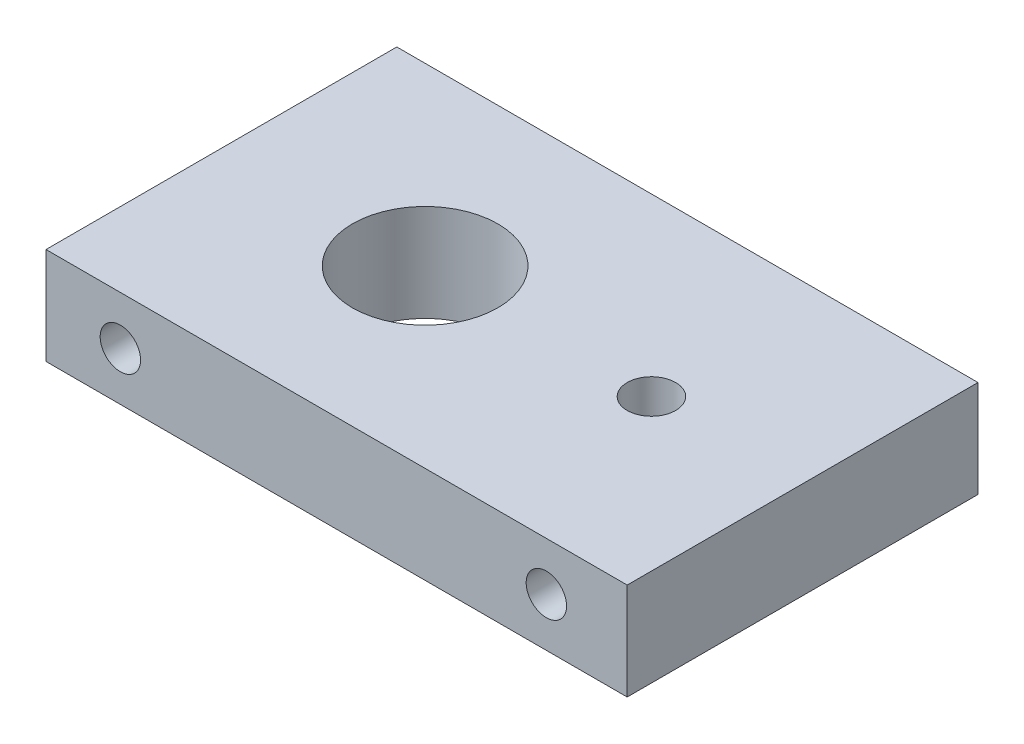
ISO-10303-21;
HEADER;
FILE_DESCRIPTION(('STEP AP214'),'2;1');
FILE_NAME('part.step','',(''),(''),'','','');
FILE_SCHEMA(('AUTOMOTIVE_DESIGN { 1 0 10303 214 1 1 1 1 }'));
ENDSEC;
DATA;
#1=APPLICATION_CONTEXT('core data for automotive mechanical design processes');
#2=APPLICATION_PROTOCOL_DEFINITION('international standard','automotive_design',2000,#1);
#3=PRODUCT_CONTEXT('',#1,'mechanical');
#4=PRODUCT('Part','Part','',(#3));
#5=PRODUCT_RELATED_PRODUCT_CATEGORY('part','',(#4));
#6=PRODUCT_DEFINITION_FORMATION('','',#4);
#7=PRODUCT_DEFINITION_CONTEXT('part definition',#1,'design');
#8=PRODUCT_DEFINITION('design','',#6,#7);
#9=PRODUCT_DEFINITION_SHAPE('','',#8);
#10=(LENGTH_UNIT() NAMED_UNIT(*) SI_UNIT(.MILLI.,.METRE.));
#11=(NAMED_UNIT(*) PLANE_ANGLE_UNIT() SI_UNIT($,.RADIAN.));
#12=(NAMED_UNIT(*) SI_UNIT($,.STERADIAN.) SOLID_ANGLE_UNIT());
#13=UNCERTAINTY_MEASURE_WITH_UNIT(LENGTH_MEASURE(1.E-05),#10,'distance_accuracy_value','');
#14=(GEOMETRIC_REPRESENTATION_CONTEXT(3) GLOBAL_UNCERTAINTY_ASSIGNED_CONTEXT((#13)) GLOBAL_UNIT_ASSIGNED_CONTEXT((#10,
#11,#12)) REPRESENTATION_CONTEXT('',''));
#15=CARTESIAN_POINT('',(0.,0.,0.));
#16=DIRECTION('',(0.,0.,1.));
#17=DIRECTION('',(1.,0.,0.));
#18=AXIS2_PLACEMENT_3D('',#15,#16,#17);
#19=CARTESIAN_POINT('',(23.35,231.,12.65));
#20=DIRECTION('',(-1.,0.,0.));
#21=DIRECTION('',(0.,0.,1.));
#22=AXIS2_PLACEMENT_3D('',#19,#20,#21);
#23=PLANE('',#22);
#24=DIRECTION('',(0.,0.,-1.));
#25=VECTOR('',#24,1.);
#26=CARTESIAN_POINT('',(23.35,237.,12.65));
#27=LINE('',#26,#25);
#28=CARTESIAN_POINT('',(23.35,237.,10.85));
#29=VERTEX_POINT('',#28);
#30=CARTESIAN_POINT('',(23.35,237.,-10.85));
#31=VERTEX_POINT('',#30);
#32=EDGE_CURVE('E95',#29,#31,#27,.T.);
#33=ORIENTED_EDGE('',*,*,#32,.F.);
#34=DIRECTION('',(0.,-1.,0.));
#35=VECTOR('',#34,1.);
#36=CARTESIAN_POINT('',(23.35,290.644027607927,10.85));
#37=LINE('',#36,#35);
#38=CARTESIAN_POINT('',(23.35,231.,10.85));
#39=VERTEX_POINT('',#38);
#40=EDGE_CURVE('E98',#29,#39,#37,.T.);
#41=ORIENTED_EDGE('',*,*,#40,.T.);
#42=DIRECTION('',(0.,0.,-1.));
#43=VECTOR('',#42,1.);
#44=CARTESIAN_POINT('',(23.35,231.,12.65));
#45=LINE('',#44,#43);
#46=CARTESIAN_POINT('',(23.35,231.,-10.85));
#47=VERTEX_POINT('',#46);
#48=EDGE_CURVE('E97',#39,#47,#45,.T.);
#49=ORIENTED_EDGE('',*,*,#48,.T.);
#50=DIRECTION('',(0.,-1.,0.));
#51=VECTOR('',#50,1.);
#52=CARTESIAN_POINT('',(23.35,290.644027607927,-10.85));
#53=LINE('',#52,#51);
#54=EDGE_CURVE('E56',#31,#47,#53,.T.);
#55=ORIENTED_EDGE('',*,*,#54,.F.);
#56=EDGE_LOOP('',(#33,#41,#49,#55));
#57=FACE_BOUND('',#56,.T.);
#58=ADVANCED_FACE('F40',(#57),#23,.F.);
#59=CARTESIAN_POINT('',(-23.35,237.,12.65));
#60=DIRECTION('',(0.,-1.,0.));
#61=DIRECTION('',(0.,0.,-1.));
#62=AXIS2_PLACEMENT_3D('',#59,#60,#61);
#63=PLANE('',#62);
#64=CARTESIAN_POINT('',(0.,237.,0.));
#65=DIRECTION('',(0.,-1.,0.));
#66=DIRECTION('',(0.,0.,-1.));
#67=AXIS2_PLACEMENT_3D('',#64,#65,#66);
#68=CIRCLE('',#67,4.5);
#69=CARTESIAN_POINT('',(0.,237.,-4.5));
#70=VERTEX_POINT('',#69);
#71=EDGE_CURVE('E110',#70,#70,#68,.T.);
#72=ORIENTED_EDGE('',*,*,#71,.T.);
#73=EDGE_LOOP('',(#72));
#74=FACE_BOUND('',#73,.T.);
#75=CARTESIAN_POINT('',(14.,237.,0.));
#76=DIRECTION('',(0.,-1.,0.));
#77=DIRECTION('',(0.,0.,-1.));
#78=AXIS2_PLACEMENT_3D('',#75,#76,#77);
#79=CIRCLE('',#78,1.5);
#80=CARTESIAN_POINT('',(14.,237.,-1.5));
#81=VERTEX_POINT('',#80);
#82=EDGE_CURVE('E116',#81,#81,#79,.T.);
#83=ORIENTED_EDGE('',*,*,#82,.T.);
#84=EDGE_LOOP('',(#83));
#85=FACE_BOUND('',#84,.T.);
#86=DIRECTION('',(0.,0.,-1.));
#87=VECTOR('',#86,1.);
#88=CARTESIAN_POINT('',(-12.6,237.,-10.85));
#89=LINE('',#88,#87);
#90=CARTESIAN_POINT('',(-12.6,237.,10.85));
#91=VERTEX_POINT('',#90);
#92=CARTESIAN_POINT('',(-12.6,237.,-10.85));
#93=VERTEX_POINT('',#92);
#94=EDGE_CURVE('E89',#91,#93,#89,.T.);
#95=ORIENTED_EDGE('',*,*,#94,.F.);
#96=DIRECTION('',(-1.,0.,0.));
#97=VECTOR('',#96,1.);
#98=CARTESIAN_POINT('',(23.35,237.,10.85));
#99=LINE('',#98,#97);
#100=EDGE_CURVE('E88',#29,#91,#99,.T.);
#101=ORIENTED_EDGE('',*,*,#100,.F.);
#102=ORIENTED_EDGE('',*,*,#32,.T.);
#103=DIRECTION('',(1.,0.,0.));
#104=VECTOR('',#103,1.);
#105=CARTESIAN_POINT('',(23.35,237.,-10.85));
#106=LINE('',#105,#104);
#107=EDGE_CURVE('E82',#93,#31,#106,.T.);
#108=ORIENTED_EDGE('',*,*,#107,.F.);
#109=EDGE_LOOP('',(#95,#101,#102,#108));
#110=FACE_BOUND('',#109,.T.);
#111=ADVANCED_FACE('F101',(#74,#85,#110),#63,.F.);
#112=CARTESIAN_POINT('',(-23.35,231.,12.65));
#113=DIRECTION('',(0.,1.,0.));
#114=DIRECTION('',(0.,0.,1.));
#115=AXIS2_PLACEMENT_3D('',#112,#113,#114);
#116=PLANE('',#115);
#117=CARTESIAN_POINT('',(0.,231.,0.));
#118=DIRECTION('',(0.,1.,0.));
#119=DIRECTION('',(0.,0.,1.));
#120=AXIS2_PLACEMENT_3D('',#117,#118,#119);
#121=CIRCLE('',#120,4.5);
#122=CARTESIAN_POINT('',(0.,231.,4.5));
#123=VERTEX_POINT('',#122);
#124=EDGE_CURVE('E43',#123,#123,#121,.F.);
#125=ORIENTED_EDGE('',*,*,#124,.F.);
#126=EDGE_LOOP('',(#125));
#127=FACE_BOUND('',#126,.T.);
#128=CARTESIAN_POINT('',(14.,231.,0.));
#129=DIRECTION('',(0.,1.,0.));
#130=DIRECTION('',(0.,0.,1.));
#131=AXIS2_PLACEMENT_3D('',#128,#129,#130);
#132=CIRCLE('',#131,1.5);
#133=CARTESIAN_POINT('',(14.,231.,1.5));
#134=VERTEX_POINT('',#133);
#135=EDGE_CURVE('E108',#134,#134,#132,.F.);
#136=ORIENTED_EDGE('',*,*,#135,.F.);
#137=EDGE_LOOP('',(#136));
#138=FACE_BOUND('',#137,.T.);
#139=ORIENTED_EDGE('',*,*,#48,.F.);
#140=DIRECTION('',(-1.,0.,0.));
#141=VECTOR('',#140,1.);
#142=CARTESIAN_POINT('',(-23.35,231.,10.85));
#143=LINE('',#142,#141);
#144=CARTESIAN_POINT('',(-12.6,231.,10.85));
#145=VERTEX_POINT('',#144);
#146=EDGE_CURVE('E12',#39,#145,#143,.T.);
#147=ORIENTED_EDGE('',*,*,#146,.T.);
#148=DIRECTION('',(0.,0.,-1.));
#149=VECTOR('',#148,1.);
#150=CARTESIAN_POINT('',(-12.6,231.,12.65));
#151=LINE('',#150,#149);
#152=CARTESIAN_POINT('',(-12.6,231.,-10.85));
#153=VERTEX_POINT('',#152);
#154=EDGE_CURVE('E48',#145,#153,#151,.T.);
#155=ORIENTED_EDGE('',*,*,#154,.T.);
#156=DIRECTION('',(1.,0.,0.));
#157=VECTOR('',#156,1.);
#158=CARTESIAN_POINT('',(-23.35,231.,-10.85));
#159=LINE('',#158,#157);
#160=EDGE_CURVE('E102',#153,#47,#159,.T.);
#161=ORIENTED_EDGE('',*,*,#160,.T.);
#162=EDGE_LOOP('',(#139,#147,#155,#161));
#163=FACE_BOUND('',#162,.T.);
#164=ADVANCED_FACE('F134',(#127,#138,#163),#116,.F.);
#165=CARTESIAN_POINT('',(-12.6,290.644027607927,-10.85));
#166=DIRECTION('',(1.,0.,0.));
#167=DIRECTION('',(0.,0.,-1.));
#168=AXIS2_PLACEMENT_3D('',#165,#166,#167);
#169=PLANE('',#168);
#170=DIRECTION('',(0.,-1.,0.));
#171=VECTOR('',#170,1.);
#172=CARTESIAN_POINT('',(-12.6,290.644027607927,10.85));
#173=LINE('',#172,#171);
#174=EDGE_CURVE('E114',#91,#145,#173,.T.);
#175=ORIENTED_EDGE('',*,*,#174,.F.);
#176=ORIENTED_EDGE('',*,*,#94,.T.);
#177=DIRECTION('',(0.,-1.,0.));
#178=VECTOR('',#177,1.);
#179=CARTESIAN_POINT('',(-12.6,290.644027607927,-10.85));
#180=LINE('',#179,#178);
#181=EDGE_CURVE('E84',#93,#153,#180,.T.);
#182=ORIENTED_EDGE('',*,*,#181,.T.);
#183=ORIENTED_EDGE('',*,*,#154,.F.);
#184=EDGE_LOOP('',(#175,#176,#182,#183));
#185=FACE_BOUND('',#184,.T.);
#186=ADVANCED_FACE('F132',(#185),#169,.F.);
#187=CARTESIAN_POINT('',(23.35,290.644027607927,10.85));
#188=DIRECTION('',(0.,0.,-1.));
#189=DIRECTION('',(-1.,0.,0.));
#190=AXIS2_PLACEMENT_3D('',#187,#188,#189);
#191=PLANE('',#190);
#192=CARTESIAN_POINT('',(-8.,234.,10.85));
#193=DIRECTION('',(0.,0.,-1.));
#194=DIRECTION('',(-1.,0.,0.));
#195=AXIS2_PLACEMENT_3D('',#192,#193,#194);
#196=CIRCLE('',#195,1.25);
#197=CARTESIAN_POINT('',(-9.25,234.,10.85));
#198=VERTEX_POINT('',#197);
#199=EDGE_CURVE('E289',#198,#198,#196,.T.);
#200=ORIENTED_EDGE('',*,*,#199,.T.);
#201=EDGE_LOOP('',(#200));
#202=FACE_BOUND('',#201,.T.);
#203=CARTESIAN_POINT('',(18.35,234.,10.85));
#204=DIRECTION('',(0.,0.,-1.));
#205=DIRECTION('',(-1.,0.,0.));
#206=AXIS2_PLACEMENT_3D('',#203,#204,#205);
#207=CIRCLE('',#206,1.25);
#208=CARTESIAN_POINT('',(17.1,234.,10.85));
#209=VERTEX_POINT('',#208);
#210=EDGE_CURVE('E288',#209,#209,#207,.T.);
#211=ORIENTED_EDGE('',*,*,#210,.T.);
#212=EDGE_LOOP('',(#211));
#213=FACE_BOUND('',#212,.T.);
#214=ORIENTED_EDGE('',*,*,#40,.F.);
#215=ORIENTED_EDGE('',*,*,#100,.T.);
#216=ORIENTED_EDGE('',*,*,#174,.T.);
#217=ORIENTED_EDGE('',*,*,#146,.F.);
#218=EDGE_LOOP('',(#214,#215,#216,#217));
#219=FACE_BOUND('',#218,.T.);
#220=ADVANCED_FACE('F131',(#202,#213,#219),#191,.F.);
#221=CARTESIAN_POINT('',(23.35,290.644027607927,-10.85));
#222=DIRECTION('',(0.,0.,1.));
#223=DIRECTION('',(1.,0.,0.));
#224=AXIS2_PLACEMENT_3D('',#221,#222,#223);
#225=PLANE('',#224);
#226=CARTESIAN_POINT('',(-8.,234.,-10.85));
#227=DIRECTION('',(0.,0.,1.));
#228=DIRECTION('',(1.,0.,0.));
#229=AXIS2_PLACEMENT_3D('',#226,#227,#228);
#230=CIRCLE('',#229,1.25);
#231=CARTESIAN_POINT('',(-6.75,234.,-10.85));
#232=VERTEX_POINT('',#231);
#233=EDGE_CURVE('E300',#232,#232,#230,.T.);
#234=ORIENTED_EDGE('',*,*,#233,.T.);
#235=EDGE_LOOP('',(#234));
#236=FACE_BOUND('',#235,.T.);
#237=CARTESIAN_POINT('',(18.35,234.,-10.85));
#238=DIRECTION('',(0.,0.,1.));
#239=DIRECTION('',(1.,0.,0.));
#240=AXIS2_PLACEMENT_3D('',#237,#238,#239);
#241=CIRCLE('',#240,1.25);
#242=CARTESIAN_POINT('',(19.6,234.,-10.85));
#243=VERTEX_POINT('',#242);
#244=EDGE_CURVE('E124',#243,#243,#241,.T.);
#245=ORIENTED_EDGE('',*,*,#244,.T.);
#246=EDGE_LOOP('',(#245));
#247=FACE_BOUND('',#246,.T.);
#248=ORIENTED_EDGE('',*,*,#181,.F.);
#249=ORIENTED_EDGE('',*,*,#107,.T.);
#250=ORIENTED_EDGE('',*,*,#54,.T.);
#251=ORIENTED_EDGE('',*,*,#160,.F.);
#252=EDGE_LOOP('',(#248,#249,#250,#251));
#253=FACE_BOUND('',#252,.T.);
#254=ADVANCED_FACE('F83',(#236,#247,#253),#225,.F.);
#255=CARTESIAN_POINT('',(14.,249.727922061358,0.));
#256=DIRECTION('',(0.,-1.,0.));
#257=DIRECTION('',(0.,0.,-1.));
#258=AXIS2_PLACEMENT_3D('',#255,#256,#257);
#259=CYLINDRICAL_SURFACE('',#258,1.5);
#260=ORIENTED_EDGE('',*,*,#82,.F.);
#261=EDGE_LOOP('',(#260));
#262=FACE_BOUND('',#261,.T.);
#263=ORIENTED_EDGE('',*,*,#135,.T.);
#264=EDGE_LOOP('',(#263));
#265=FACE_BOUND('',#264,.T.);
#266=ADVANCED_FACE('F181',(#262,#265),#259,.F.);
#267=CARTESIAN_POINT('',(0.,249.727922061358,0.));
#268=DIRECTION('',(0.,-1.,0.));
#269=DIRECTION('',(0.,0.,-1.));
#270=AXIS2_PLACEMENT_3D('',#267,#268,#269);
#271=CYLINDRICAL_SURFACE('',#270,4.5);
#272=ORIENTED_EDGE('',*,*,#71,.F.);
#273=EDGE_LOOP('',(#272));
#274=FACE_BOUND('',#273,.T.);
#275=ORIENTED_EDGE('',*,*,#124,.T.);
#276=EDGE_LOOP('',(#275));
#277=FACE_BOUND('',#276,.T.);
#278=ADVANCED_FACE('F189',(#274,#277),#271,.F.);
#279=CARTESIAN_POINT('',(18.35,234.,-4.85));
#280=DIRECTION('',(0.,0.,-1.));
#281=DIRECTION('',(-1.,0.,0.));
#282=AXIS2_PLACEMENT_3D('',#279,#280,#281);
#283=CYLINDRICAL_SURFACE('',#282,1.25);
#284=CARTESIAN_POINT('',(18.35,234.,-4.85));
#285=DIRECTION('',(0.,0.,1.));
#286=DIRECTION('',(1.,0.,0.));
#287=AXIS2_PLACEMENT_3D('',#284,#285,#286);
#288=CIRCLE('',#287,1.25);
#289=CARTESIAN_POINT('',(19.6,234.,-4.85));
#290=VERTEX_POINT('',#289);
#291=EDGE_CURVE('E121',#290,#290,#288,.T.);
#292=ORIENTED_EDGE('',*,*,#291,.T.);
#293=EDGE_LOOP('',(#292));
#294=FACE_BOUND('',#293,.T.);
#295=ORIENTED_EDGE('',*,*,#244,.F.);
#296=EDGE_LOOP('',(#295));
#297=FACE_BOUND('',#296,.T.);
#298=ADVANCED_FACE('F198',(#294,#297),#283,.F.);
#299=CARTESIAN_POINT('',(18.35,234.,-4.85));
#300=DIRECTION('',(0.,0.,1.));
#301=DIRECTION('',(1.,0.,0.));
#302=AXIS2_PLACEMENT_3D('',#299,#300,#301);
#303=PLANE('',#302);
#304=ORIENTED_EDGE('',*,*,#291,.F.);
#305=EDGE_LOOP('',(#304));
#306=FACE_BOUND('',#305,.T.);
#307=ADVANCED_FACE('F207',(#306),#303,.F.);
#308=CARTESIAN_POINT('',(-8.,234.,-4.85));
#309=DIRECTION('',(0.,0.,-1.));
#310=DIRECTION('',(-1.,0.,0.));
#311=AXIS2_PLACEMENT_3D('',#308,#309,#310);
#312=CYLINDRICAL_SURFACE('',#311,1.25);
#313=CARTESIAN_POINT('',(-8.,234.,-4.85));
#314=DIRECTION('',(0.,0.,1.));
#315=DIRECTION('',(1.,0.,0.));
#316=AXIS2_PLACEMENT_3D('',#313,#314,#315);
#317=CIRCLE('',#316,1.25);
#318=CARTESIAN_POINT('',(-6.75,234.,-4.85));
#319=VERTEX_POINT('',#318);
#320=EDGE_CURVE('E298',#319,#319,#317,.T.);
#321=ORIENTED_EDGE('',*,*,#320,.T.);
#322=EDGE_LOOP('',(#321));
#323=FACE_BOUND('',#322,.T.);
#324=ORIENTED_EDGE('',*,*,#233,.F.);
#325=EDGE_LOOP('',(#324));
#326=FACE_BOUND('',#325,.T.);
#327=ADVANCED_FACE('F216',(#323,#326),#312,.F.);
#328=CARTESIAN_POINT('',(-8.,234.,-4.85));
#329=DIRECTION('',(0.,0.,1.));
#330=DIRECTION('',(1.,0.,0.));
#331=AXIS2_PLACEMENT_3D('',#328,#329,#330);
#332=PLANE('',#331);
#333=ORIENTED_EDGE('',*,*,#320,.F.);
#334=EDGE_LOOP('',(#333));
#335=FACE_BOUND('',#334,.T.);
#336=ADVANCED_FACE('F225',(#335),#332,.F.);
#337=CARTESIAN_POINT('',(18.35,234.,4.85));
#338=DIRECTION('',(0.,0.,1.));
#339=DIRECTION('',(1.,0.,0.));
#340=AXIS2_PLACEMENT_3D('',#337,#338,#339);
#341=CYLINDRICAL_SURFACE('',#340,1.25);
#342=CARTESIAN_POINT('',(18.35,234.,4.85));
#343=DIRECTION('',(0.,0.,-1.));
#344=DIRECTION('',(-1.,0.,0.));
#345=AXIS2_PLACEMENT_3D('',#342,#343,#344);
#346=CIRCLE('',#345,1.25);
#347=CARTESIAN_POINT('',(17.1,234.,4.85));
#348=VERTEX_POINT('',#347);
#349=EDGE_CURVE('E292',#348,#348,#346,.T.);
#350=ORIENTED_EDGE('',*,*,#349,.T.);
#351=EDGE_LOOP('',(#350));
#352=FACE_BOUND('',#351,.T.);
#353=ORIENTED_EDGE('',*,*,#210,.F.);
#354=EDGE_LOOP('',(#353));
#355=FACE_BOUND('',#354,.T.);
#356=ADVANCED_FACE('F234',(#352,#355),#341,.F.);
#357=CARTESIAN_POINT('',(18.35,234.,4.85));
#358=DIRECTION('',(0.,0.,-1.));
#359=DIRECTION('',(-1.,0.,0.));
#360=AXIS2_PLACEMENT_3D('',#357,#358,#359);
#361=PLANE('',#360);
#362=ORIENTED_EDGE('',*,*,#349,.F.);
#363=EDGE_LOOP('',(#362));
#364=FACE_BOUND('',#363,.T.);
#365=ADVANCED_FACE('F243',(#364),#361,.F.);
#366=CARTESIAN_POINT('',(-8.,234.,4.85));
#367=DIRECTION('',(0.,0.,1.));
#368=DIRECTION('',(1.,0.,0.));
#369=AXIS2_PLACEMENT_3D('',#366,#367,#368);
#370=CYLINDRICAL_SURFACE('',#369,1.25);
#371=CARTESIAN_POINT('',(-8.,234.,4.85));
#372=DIRECTION('',(0.,0.,-1.));
#373=DIRECTION('',(-1.,0.,0.));
#374=AXIS2_PLACEMENT_3D('',#371,#372,#373);
#375=CIRCLE('',#374,1.25);
#376=CARTESIAN_POINT('',(-9.25,234.,4.85));
#377=VERTEX_POINT('',#376);
#378=EDGE_CURVE('E287',#377,#377,#375,.T.);
#379=ORIENTED_EDGE('',*,*,#378,.T.);
#380=EDGE_LOOP('',(#379));
#381=FACE_BOUND('',#380,.T.);
#382=ORIENTED_EDGE('',*,*,#199,.F.);
#383=EDGE_LOOP('',(#382));
#384=FACE_BOUND('',#383,.T.);
#385=ADVANCED_FACE('F252',(#381,#384),#370,.F.);
#386=CARTESIAN_POINT('',(-8.,234.,4.85));
#387=DIRECTION('',(0.,0.,-1.));
#388=DIRECTION('',(-1.,0.,0.));
#389=AXIS2_PLACEMENT_3D('',#386,#387,#388);
#390=PLANE('',#389);
#391=ORIENTED_EDGE('',*,*,#378,.F.);
#392=EDGE_LOOP('',(#391));
#393=FACE_BOUND('',#392,.T.);
#394=ADVANCED_FACE('F261',(#393),#390,.F.);
#395=CLOSED_SHELL('',(#58,#111,#164,#186,#220,#254,#266,#278,#298,#307,#327,#336,#356,#365,#385,#394));
#396=MANIFOLD_SOLID_BREP('B2',#395);
#397=ADVANCED_BREP_SHAPE_REPRESENTATION('',(#18,#396),#14);
#398=SHAPE_DEFINITION_REPRESENTATION(#9,#397);
ENDSEC;
END-ISO-10303-21;
